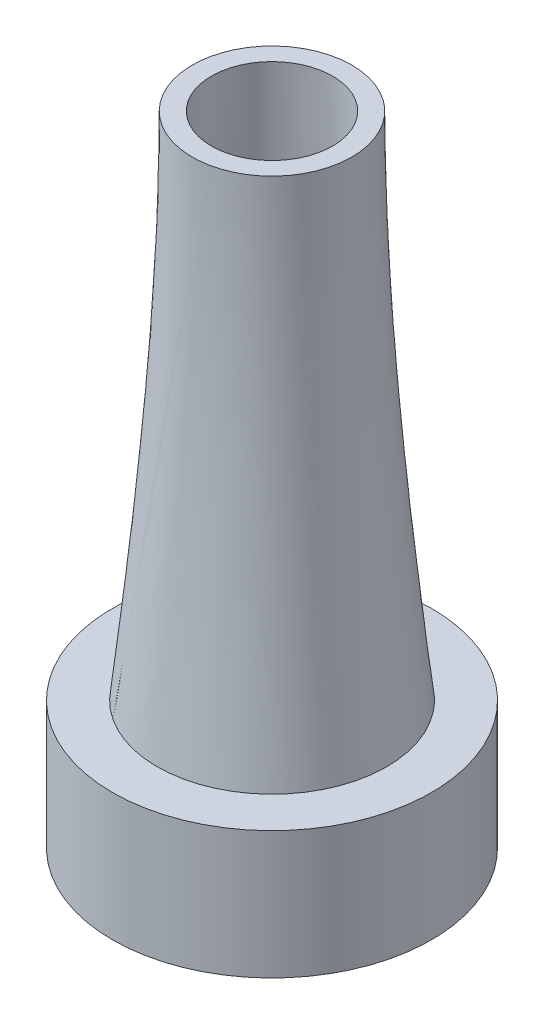
ISO-10303-21;
HEADER;
FILE_DESCRIPTION(('STEP AP214'),'2;1');
FILE_NAME('part.step','',(''),(''),'','','');
FILE_SCHEMA(('AUTOMOTIVE_DESIGN { 1 0 10303 214 1 1 1 1 }'));
ENDSEC;
DATA;
#1=APPLICATION_CONTEXT('core data for automotive mechanical design processes');
#2=APPLICATION_PROTOCOL_DEFINITION('international standard','automotive_design',2000,#1);
#3=PRODUCT_CONTEXT('',#1,'mechanical');
#4=PRODUCT('Part','Part','',(#3));
#5=PRODUCT_RELATED_PRODUCT_CATEGORY('part','',(#4));
#6=PRODUCT_DEFINITION_FORMATION('','',#4);
#7=PRODUCT_DEFINITION_CONTEXT('part definition',#1,'design');
#8=PRODUCT_DEFINITION('design','',#6,#7);
#9=PRODUCT_DEFINITION_SHAPE('','',#8);
#10=(LENGTH_UNIT() NAMED_UNIT(*) SI_UNIT(.MILLI.,.METRE.));
#11=(NAMED_UNIT(*) PLANE_ANGLE_UNIT() SI_UNIT($,.RADIAN.));
#12=(NAMED_UNIT(*) SI_UNIT($,.STERADIAN.) SOLID_ANGLE_UNIT());
#13=UNCERTAINTY_MEASURE_WITH_UNIT(LENGTH_MEASURE(1.E-05),#10,'distance_accuracy_value','');
#14=(GEOMETRIC_REPRESENTATION_CONTEXT(3) GLOBAL_UNCERTAINTY_ASSIGNED_CONTEXT((#13)) GLOBAL_UNIT_ASSIGNED_CONTEXT((#10,
#11,#12)) REPRESENTATION_CONTEXT('',''));
#15=CARTESIAN_POINT('',(0.,0.,0.));
#16=DIRECTION('',(0.,0.,1.));
#17=DIRECTION('',(1.,0.,0.));
#18=AXIS2_PLACEMENT_3D('',#15,#16,#17);
#19=CARTESIAN_POINT('',(0.,20.,0.));
#20=DIRECTION('',(0.,1.,0.));
#21=DIRECTION('',(0.,0.,1.));
#22=AXIS2_PLACEMENT_3D('',#19,#20,#21);
#23=PLANE('',#22);
#24=CARTESIAN_POINT('',(0.,20.,0.));
#25=DIRECTION('',(0.,1.,0.));
#26=DIRECTION('',(0.,0.,1.));
#27=AXIS2_PLACEMENT_3D('',#24,#25,#26);
#28=CIRCLE('',#27,25.);
#29=CARTESIAN_POINT('',(0.,20.,25.));
#30=VERTEX_POINT('',#29);
#31=EDGE_CURVE('E11',#30,#30,#28,.T.);
#32=ORIENTED_EDGE('',*,*,#31,.T.);
#33=EDGE_LOOP('',(#32));
#34=FACE_BOUND('',#33,.T.);
#35=CARTESIAN_POINT('',(0.,20.,0.));
#36=DIRECTION('',(0.,1.,0.));
#37=DIRECTION('',(0.,0.,1.));
#38=AXIS2_PLACEMENT_3D('',#35,#36,#37);
#39=CIRCLE('',#38,18.);
#40=CARTESIAN_POINT('',(-9.84456851819906,20.,15.0693221709035));
#41=VERTEX_POINT('',#40);
#42=EDGE_CURVE('E49',#41,#41,#39,.T.);
#43=ORIENTED_EDGE('',*,*,#42,.F.);
#44=EDGE_LOOP('',(#43));
#45=FACE_BOUND('',#44,.T.);
#46=ADVANCED_FACE('F32',(#34,#45),#23,.T.);
#47=CARTESIAN_POINT('',(0.,20.,0.));
#48=DIRECTION('',(0.,-1.,0.));
#49=DIRECTION('',(0.,0.,-1.));
#50=AXIS2_PLACEMENT_3D('',#47,#48,#49);
#51=CYLINDRICAL_SURFACE('',#50,25.);
#52=ORIENTED_EDGE('',*,*,#31,.F.);
#53=EDGE_LOOP('',(#52));
#54=FACE_BOUND('',#53,.T.);
#55=CARTESIAN_POINT('',(0.,0.,0.));
#56=DIRECTION('',(0.,1.,0.));
#57=DIRECTION('',(0.,0.,1.));
#58=AXIS2_PLACEMENT_3D('',#55,#56,#57);
#59=CIRCLE('',#58,25.);
#60=CARTESIAN_POINT('',(0.,0.,25.));
#61=VERTEX_POINT('',#60);
#62=EDGE_CURVE('E36',#61,#61,#59,.T.);
#63=ORIENTED_EDGE('',*,*,#62,.T.);
#64=EDGE_LOOP('',(#63));
#65=FACE_BOUND('',#64,.T.);
#66=ADVANCED_FACE('F34',(#54,#65),#51,.T.);
#67=CARTESIAN_POINT('',(0.,0.,0.));
#68=DIRECTION('',(0.,1.,0.));
#69=DIRECTION('',(0.,0.,1.));
#70=AXIS2_PLACEMENT_3D('',#67,#68,#69);
#71=PLANE('',#70);
#72=ORIENTED_EDGE('',*,*,#62,.F.);
#73=EDGE_LOOP('',(#72));
#74=FACE_BOUND('',#73,.T.);
#75=ADVANCED_FACE('F66',(#74),#71,.F.);
#76=CARTESIAN_POINT('',(0.,100.,0.));
#77=DIRECTION('',(0.,1.,0.));
#78=DIRECTION('',(0.,0.,1.));
#79=AXIS2_PLACEMENT_3D('',#76,#77,#78);
#80=PLANE('',#79);
#81=CARTESIAN_POINT('',(0.,100.,0.));
#82=DIRECTION('',(0.,1.,0.));
#83=DIRECTION('',(0.,0.,1.));
#84=AXIS2_PLACEMENT_3D('',#81,#82,#83);
#85=CIRCLE('',#84,9.5);
#86=CARTESIAN_POINT('',(0.,100.,9.5));
#87=VERTEX_POINT('',#86);
#88=EDGE_CURVE('E129',#87,#87,#85,.T.);
#89=ORIENTED_EDGE('',*,*,#88,.F.);
#90=EDGE_LOOP('',(#89));
#91=FACE_BOUND('',#90,.T.);
#92=CARTESIAN_POINT('',(0.,100.,0.));
#93=DIRECTION('',(0.,1.,0.));
#94=DIRECTION('',(0.,0.,1.));
#95=AXIS2_PLACEMENT_3D('',#92,#93,#94);
#96=CIRCLE('',#95,12.5);
#97=CARTESIAN_POINT('',(2.38853887443993,100.,12.2696732656289));
#98=VERTEX_POINT('',#97);
#99=EDGE_CURVE('E43',#98,#98,#96,.T.);
#100=ORIENTED_EDGE('',*,*,#99,.T.);
#101=EDGE_LOOP('',(#100));
#102=FACE_BOUND('',#101,.T.);
#103=ADVANCED_FACE('F55',(#91,#102),#80,.T.);
#104=CARTESIAN_POINT('',(-9.84456851819906,20.,15.0693221709035));
#105=CARTESIAN_POINT('',(2.38853887443993,100.,12.2696732656289));
#106=CARTESIAN_POINT('',(20.2940758236079,20.,34.7584592073016));
#107=CARTESIAN_POINT('',(26.9278854056978,100.,7.49259551674906));
#108=CARTESIAN_POINT('',(39.983212860006,20.,4.61981486549462));
#109=CARTESIAN_POINT('',(22.1508076568179,100.,-17.0467510145088));
#110=CARTESIAN_POINT('',(9.84456851819907,20.,-15.0693221709035));
#111=CARTESIAN_POINT('',(-2.38853887443994,100.,-12.2696732656289));
#112=CARTESIAN_POINT('',(-20.2940758236079,20.,-34.7584592073016));
#113=CARTESIAN_POINT('',(-26.9278854056978,100.,-7.49259551674906));
#114=CARTESIAN_POINT('',(-39.9832128600061,20.,-4.61981486549464));
#115=CARTESIAN_POINT('',(-22.1508076568179,100.,17.0467510145088));
#116=CARTESIAN_POINT('',(-9.84456851819906,20.,15.0693221709035));
#117=CARTESIAN_POINT('',(2.38853887443993,100.,12.2696732656289));
#118=(BOUNDED_SURFACE() B_SPLINE_SURFACE(3,1,((#104,#105),(#106,#107),(#108,#109),(#110,#111),
(#112,#113),(#114,#115),(#116,#117)),.UNSPECIFIED.,.T.,.F.,.F.) B_SPLINE_SURFACE_WITH_KNOTS((4,
3,4),(2,2),(0.,0.5,1.),(0.,1.),
.UNSPECIFIED.) GEOMETRIC_REPRESENTATION_ITEM() RATIONAL_B_SPLINE_SURFACE(((1.,1.),
(0.333333333333334,0.333333333333333),(0.333333333333334,0.333333333333333),(1.,1.),
(0.333333333333333,0.333333333333334),(0.333333333333333,0.333333333333334),(1.,1.))) REPRESENTATION_ITEM('') SURFACE());
#119=CARTESIAN_POINT('',(-9.84456851819906,20.,15.0693221709035));
#120=CARTESIAN_POINT('',(-9.7171403161924,20.8333333333333,15.0401591614736));
#121=CARTESIAN_POINT('',(-9.58971211418575,21.6666666666667,15.0109961520436));
#122=CARTESIAN_POINT('',(-9.33485571017243,23.3333333333333,14.9526701331837));
#123=CARTESIAN_POINT('',(-9.20742750816578,24.1666666666667,14.9235071237538));
#124=CARTESIAN_POINT('',(-8.95257110415246,25.8333333333333,14.8651811048939));
#125=CARTESIAN_POINT('',(-8.82514290214581,26.6666666666667,14.836018095464));
#126=CARTESIAN_POINT('',(-8.57028649813249,28.3333333333333,14.7776920766041));
#127=CARTESIAN_POINT('',(-8.44285829612584,29.1666666666667,14.7485290671741));
#128=CARTESIAN_POINT('',(-8.18800189211253,30.8333333333333,14.6902030483142));
#129=CARTESIAN_POINT('',(-8.06057369010587,31.6666666666667,14.6610400388843));
#130=CARTESIAN_POINT('',(-7.80571728609256,33.3333333333333,14.6027140200244));
#131=CARTESIAN_POINT('',(-7.6782890840859,34.1666666666667,14.5735510105945));
#132=CARTESIAN_POINT('',(-7.42343268007259,35.8333333333333,14.5152249917346));
#133=CARTESIAN_POINT('',(-7.29600447806594,36.6666666666667,14.4860619823046));
#134=CARTESIAN_POINT('',(-7.04114807405262,38.3333333333333,14.4277359634447));
#135=CARTESIAN_POINT('',(-6.91371987204597,39.1666666666667,14.3985729540148));
#136=CARTESIAN_POINT('',(-6.65886346803265,40.8333333333333,14.3402469351549));
#137=CARTESIAN_POINT('',(-6.531435266026,41.6666666666667,14.311083925725));
#138=CARTESIAN_POINT('',(-6.27657886201269,43.3333333333333,14.2527579068651));
#139=CARTESIAN_POINT('',(-6.14915066000603,44.1666666666667,14.2235948974351));
#140=CARTESIAN_POINT('',(-5.89429425599272,45.8333333333333,14.1652688785753));
#141=CARTESIAN_POINT('',(-5.76686605398606,46.6666666666667,14.1361058691453));
#142=CARTESIAN_POINT('',(-5.51200964997275,48.3333333333333,14.0777798502854));
#143=CARTESIAN_POINT('',(-5.38458144796609,49.1666666666667,14.0486168408555));
#144=CARTESIAN_POINT('',(-5.12972504395278,50.8333333333333,13.9902908219956));
#145=CARTESIAN_POINT('',(-5.00229684194612,51.6666666666667,13.9611278125656));
#146=CARTESIAN_POINT('',(-4.74744043793281,53.3333333333333,13.9028017937058));
#147=CARTESIAN_POINT('',(-4.62001223592616,54.1666666666667,13.8736387842758));
#148=CARTESIAN_POINT('',(-4.36515583191284,55.8333333333333,13.8153127654159));
#149=CARTESIAN_POINT('',(-4.23772762990619,56.6666666666667,13.786149755986));
#150=CARTESIAN_POINT('',(-3.98287122589287,58.3333333333333,13.7278237371261));
#151=CARTESIAN_POINT('',(-3.85544302388622,59.1666666666667,13.6986607276962));
#152=CARTESIAN_POINT('',(-3.60058661987291,60.8333333333333,13.6403347088363));
#153=CARTESIAN_POINT('',(-3.47315841786625,61.6666666666667,13.6111716994063));
#154=CARTESIAN_POINT('',(-3.21830201385294,63.3333333333333,13.5528456805464));
#155=CARTESIAN_POINT('',(-3.09087381184628,64.1666666666667,13.5236826711165));
#156=CARTESIAN_POINT('',(-2.83601740783297,65.8333333333333,13.4653566522566));
#157=CARTESIAN_POINT('',(-2.70858920582631,66.6666666666667,13.4361936428267));
#158=CARTESIAN_POINT('',(-2.453732801813,68.3333333333333,13.3778676239668));
#159=CARTESIAN_POINT('',(-2.32630459980634,69.1666666666667,13.3487046145368));
#160=CARTESIAN_POINT('',(-2.07144819579303,70.8333333333333,13.290378595677));
#161=CARTESIAN_POINT('',(-1.94401999378638,71.6666666666667,13.261215586247));
#162=CARTESIAN_POINT('',(-1.68916358977306,73.3333333333333,13.2028895673871));
#163=CARTESIAN_POINT('',(-1.56173538776641,74.1666666666667,13.1737265579572));
#164=CARTESIAN_POINT('',(-1.30687898375309,75.8333333333333,13.1154005390973));
#165=CARTESIAN_POINT('',(-1.17945078174644,76.6666666666667,13.0862375296673));
#166=CARTESIAN_POINT('',(-0.924594377733126,78.3333333333334,13.0279115108075));
#167=CARTESIAN_POINT('',(-0.79716617572647,79.1666666666667,12.9987485013775));
#168=CARTESIAN_POINT('',(-0.542309771713158,80.8333333333333,12.9404224825176));
#169=CARTESIAN_POINT('',(-0.414881569706501,81.6666666666667,12.9112594730877));
#170=CARTESIAN_POINT('',(-0.160025165693188,83.3333333333333,12.8529334542278));
#171=CARTESIAN_POINT('',(-0.0325969636865327,84.1666666666667,12.8237704447979));
#172=CARTESIAN_POINT('',(0.222259440326779,85.8333333333333,12.765444425938));
#173=CARTESIAN_POINT('',(0.349687642333435,86.6666666666667,12.736281416508));
#174=CARTESIAN_POINT('',(0.604544046346748,88.3333333333333,12.6779553976481));
#175=CARTESIAN_POINT('',(0.731972248353404,89.1666666666667,12.6487923882182));
#176=CARTESIAN_POINT('',(0.986828652366717,90.8333333333333,12.5904663693583));
#177=CARTESIAN_POINT('',(1.11425685437337,91.6666666666667,12.5613033599284));
#178=CARTESIAN_POINT('',(1.36911325838668,93.3333333333333,12.5029773410685));
#179=CARTESIAN_POINT('',(1.49654146039334,94.1666666666667,12.4738143316385));
#180=CARTESIAN_POINT('',(1.75139786440665,95.8333333333333,12.4154883127786));
#181=CARTESIAN_POINT('',(1.87882606641331,96.6666666666667,12.3863253033487));
#182=CARTESIAN_POINT('',(2.13368247042662,98.3333333333333,12.3279992844888));
#183=CARTESIAN_POINT('',(2.26111067243328,99.1666666666667,12.2988362750589));
#184=CARTESIAN_POINT('',(2.38853887443993,100.,12.2696732656289));
#185=B_SPLINE_CURVE_WITH_KNOTS('',3,(#119,#120,#121,#122,#123,#124,#125,#126,#127,#128,#129,
#130,#131,#132,#133,#134,#135,#136,#137,#138,#139,#140,#141,#142,#143,#144,#145,#146,#147,#148,
#149,#150,#151,#152,#153,#154,#155,#156,#157,#158,#159,#160,#161,#162,#163,#164,#165,#166,#167,
#168,#169,#170,#171,#172,#173,#174,#175,#176,#177,#178,#179,#180,#181,#182,#183,#184),
.UNSPECIFIED.,.F.,.F.,(4,2,2,2,2,2,2,2,2,2,2,2,2,2,2,2,2,2,2,2,2,2,2,2,2,2,2,2,2,2,2,2,4),(0.,
2.53057223767095,5.06114447534189,7.59171671301284,10.1222889506838,12.6528611883547,
15.1834334260257,17.7140056636966,20.2445779013676,22.7751501390385,25.3057223767095,
27.8362946143804,30.3668668520514,32.8974390897223,35.4280113273932,37.9585835650642,
40.4891558027351,43.0197280404061,45.550300278077,48.080872515748,50.6114447534189,
53.1420169910899,55.6725892287608,58.2031614664318,60.7337337041027,63.2643059417736,
65.7948781794446,68.3254504171155,70.8560226547865,73.3865948924574,75.9171671301284,
78.4477393677993,80.9783116054703),.UNSPECIFIED.);
#186=EDGE_CURVE('BSEAM65',#41,#98,#185,.T.);
#187=ORIENTED_EDGE('',*,*,#42,.T.);
#188=ORIENTED_EDGE('',*,*,#99,.F.);
#189=ORIENTED_EDGE('',*,*,#186,.T.);
#190=ORIENTED_EDGE('',*,*,#186,.F.);
#191=EDGE_LOOP('',(#187,#189,#188,#190));
#192=FACE_BOUND('',#191,.T.);
#193=ADVANCED_FACE('F65',(#192),#118,.T.);
#194=CARTESIAN_POINT('',(0.,100.,0.));
#195=DIRECTION('',(0.,-1.,0.));
#196=DIRECTION('',(0.,0.,1.));
#197=AXIS2_PLACEMENT_3D('',#194,#195,#196);
#198=CONICAL_SURFACE('',#197,9.5,0.0523598775598299);
#199=CARTESIAN_POINT('',(0.,20.,0.));
#200=DIRECTION('',(0.,1.,0.));
#201=DIRECTION('',(0.,0.,1.));
#202=AXIS2_PLACEMENT_3D('',#199,#200,#201);
#203=CIRCLE('',#202,13.6926223426433);
#204=CARTESIAN_POINT('',(0.,20.,13.6926223426433));
#205=VERTEX_POINT('',#204);
#206=EDGE_CURVE('E128',#205,#205,#203,.T.);
#207=ORIENTED_EDGE('',*,*,#206,.F.);
#208=EDGE_LOOP('',(#207));
#209=FACE_BOUND('',#208,.T.);
#210=ORIENTED_EDGE('',*,*,#88,.T.);
#211=EDGE_LOOP('',(#210));
#212=FACE_BOUND('',#211,.T.);
#213=ADVANCED_FACE('F99',(#209,#212),#198,.F.);
#214=CARTESIAN_POINT('',(0.,20.,0.));
#215=DIRECTION('',(0.,1.,0.));
#216=DIRECTION('',(0.,0.,1.));
#217=AXIS2_PLACEMENT_3D('',#214,#215,#216);
#218=PLANE('',#217);
#219=ORIENTED_EDGE('',*,*,#206,.T.);
#220=EDGE_LOOP('',(#219));
#221=FACE_BOUND('',#220,.T.);
#222=ADVANCED_FACE('F113',(#221),#218,.T.);
#223=CLOSED_SHELL('',(#46,#66,#75,#103,#193,#213,#222));
#224=MANIFOLD_SOLID_BREP('B2',#223);
#225=ADVANCED_BREP_SHAPE_REPRESENTATION('',(#18,#224),#14);
#226=SHAPE_DEFINITION_REPRESENTATION(#9,#225);
ENDSEC;
END-ISO-10303-21;
